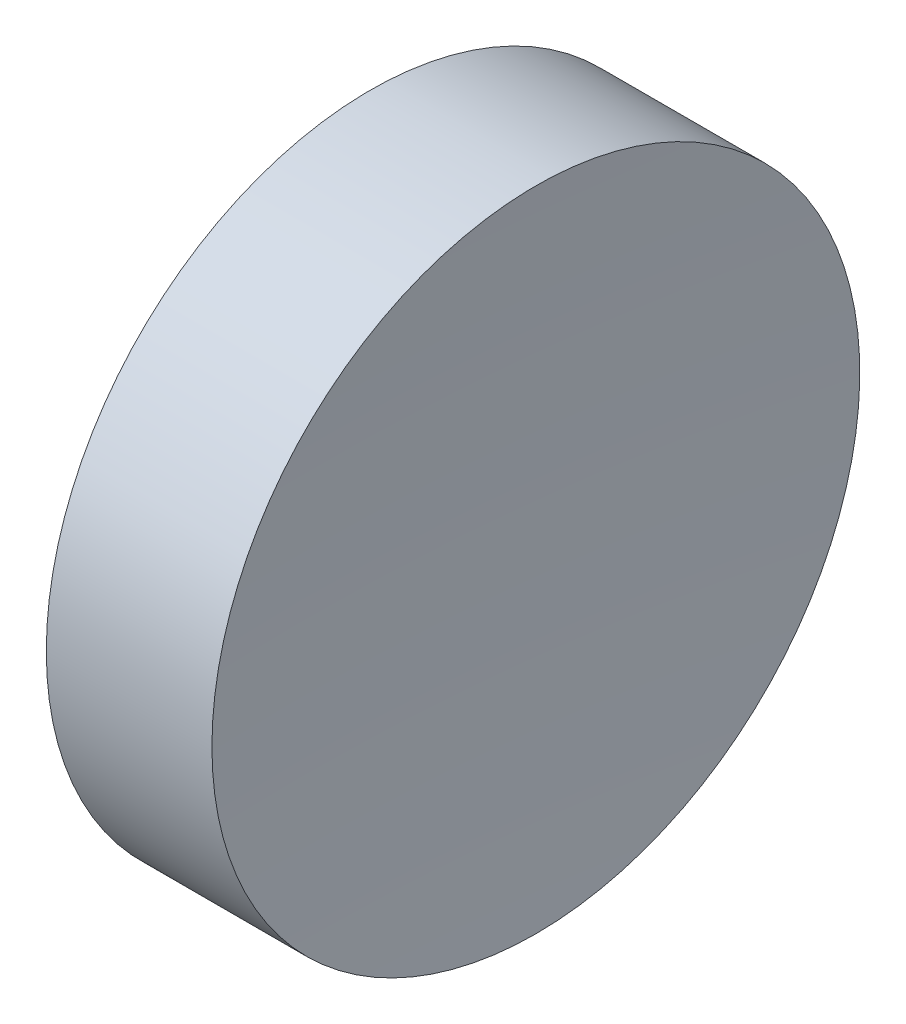
ISO-10303-21;
HEADER;
FILE_DESCRIPTION(('STEP AP214'),'2;1');
FILE_NAME('part.step','',(''),(''),'','','');
FILE_SCHEMA(('AUTOMOTIVE_DESIGN { 1 0 10303 214 1 1 1 1 }'));
ENDSEC;
DATA;
#1=APPLICATION_CONTEXT('core data for automotive mechanical design processes');
#2=APPLICATION_PROTOCOL_DEFINITION('international standard','automotive_design',2000,#1);
#3=PRODUCT_CONTEXT('',#1,'mechanical');
#4=PRODUCT('Part','Part','',(#3));
#5=PRODUCT_RELATED_PRODUCT_CATEGORY('part','',(#4));
#6=PRODUCT_DEFINITION_FORMATION('','',#4);
#7=PRODUCT_DEFINITION_CONTEXT('part definition',#1,'design');
#8=PRODUCT_DEFINITION('design','',#6,#7);
#9=PRODUCT_DEFINITION_SHAPE('','',#8);
#10=(LENGTH_UNIT() NAMED_UNIT(*) SI_UNIT(.MILLI.,.METRE.));
#11=(NAMED_UNIT(*) PLANE_ANGLE_UNIT() SI_UNIT($,.RADIAN.));
#12=(NAMED_UNIT(*) SI_UNIT($,.STERADIAN.) SOLID_ANGLE_UNIT());
#13=UNCERTAINTY_MEASURE_WITH_UNIT(LENGTH_MEASURE(1.E-05),#10,'distance_accuracy_value','');
#14=(GEOMETRIC_REPRESENTATION_CONTEXT(3) GLOBAL_UNCERTAINTY_ASSIGNED_CONTEXT((#13)) GLOBAL_UNIT_ASSIGNED_CONTEXT((#10,
#11,#12)) REPRESENTATION_CONTEXT('',''));
#15=CARTESIAN_POINT('',(0.,0.,0.));
#16=DIRECTION('',(0.,0.,1.));
#17=DIRECTION('',(1.,0.,0.));
#18=AXIS2_PLACEMENT_3D('',#15,#16,#17);
#19=CARTESIAN_POINT('',(160.546327907897,34.6890105616862,0.));
#20=DIRECTION('',(-1.,0.,0.));
#21=DIRECTION('',(0.,-1.,0.));
#22=AXIS2_PLACEMENT_3D('',#19,#20,#21);
#23=SPHERICAL_SURFACE('',#22,100.);
#24=CARTESIAN_POINT('',(60.7418315162017,34.6890105616862,0.));
#25=DIRECTION('',(-1.,0.,0.));
#26=DIRECTION('',(0.,0.,1.));
#27=AXIS2_PLACEMENT_3D('',#24,#25,#26);
#28=CIRCLE('',#27,6.25000000000001);
#29=CARTESIAN_POINT('',(60.7418315162017,34.6890105616862,6.25000000000001));
#30=VERTEX_POINT('',#29);
#31=EDGE_CURVE('E10',#30,#30,#28,.T.);
#32=ORIENTED_EDGE('',*,*,#31,.F.);
#33=EDGE_LOOP('',(#32));
#34=FACE_BOUND('',#33,.T.);
#35=ADVANCED_FACE('F35',(#34),#23,.F.);
#36=CARTESIAN_POINT('',(54.4925715010826,34.6890105616862,0.));
#37=DIRECTION('',(-1.,0.,0.));
#38=DIRECTION('',(0.,0.,1.));
#39=AXIS2_PLACEMENT_3D('',#36,#37,#38);
#40=CYLINDRICAL_SURFACE('',#39,6.25);
#41=CARTESIAN_POINT('',(57.5463277674598,34.6890105616862,0.));
#42=DIRECTION('',(-1.,0.,0.));
#43=DIRECTION('',(0.,0.,1.));
#44=AXIS2_PLACEMENT_3D('',#41,#42,#43);
#45=CIRCLE('',#44,6.25);
#46=CARTESIAN_POINT('',(57.5463277674598,34.6890105616862,6.25));
#47=VERTEX_POINT('',#46);
#48=EDGE_CURVE('E41',#47,#47,#45,.T.);
#49=ORIENTED_EDGE('',*,*,#48,.F.);
#50=EDGE_LOOP('',(#49));
#51=FACE_BOUND('',#50,.T.);
#52=ORIENTED_EDGE('',*,*,#31,.T.);
#53=EDGE_LOOP('',(#52));
#54=FACE_BOUND('',#53,.T.);
#55=ADVANCED_FACE('F49',(#51,#54),#40,.T.);
#56=CARTESIAN_POINT('',(57.5463277674598,34.6890105616862,0.));
#57=DIRECTION('',(1.,0.,0.));
#58=DIRECTION('',(0.,0.,-1.));
#59=AXIS2_PLACEMENT_3D('',#56,#57,#58);
#60=PLANE('',#59);
#61=ORIENTED_EDGE('',*,*,#48,.T.);
#62=EDGE_LOOP('',(#61));
#63=FACE_BOUND('',#62,.T.);
#64=ADVANCED_FACE('F47',(#63),#60,.F.);
#65=CLOSED_SHELL('',(#35,#55,#64));
#66=MANIFOLD_SOLID_BREP('B2',#65);
#67=ADVANCED_BREP_SHAPE_REPRESENTATION('',(#18,#66),#14);
#68=SHAPE_DEFINITION_REPRESENTATION(#9,#67);
ENDSEC;
END-ISO-10303-21;
